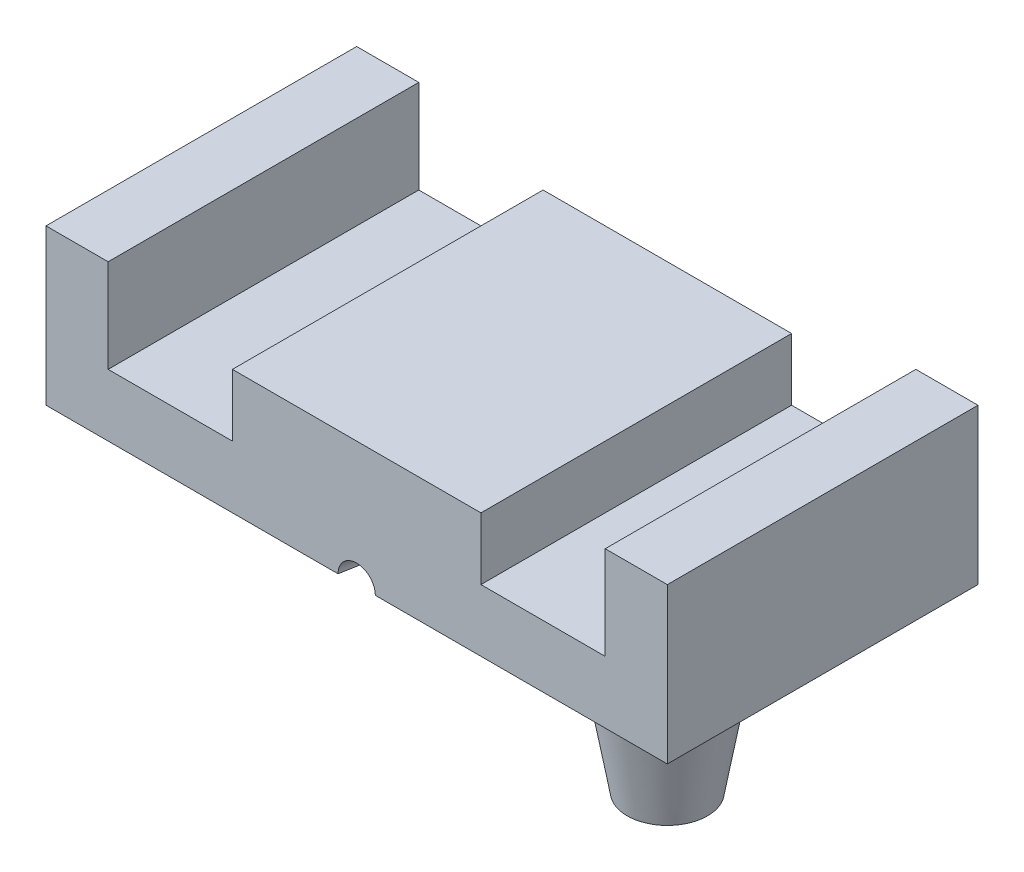
ISO-10303-21;
HEADER;
FILE_DESCRIPTION(('STEP AP214'),'2;1');
FILE_NAME('part.step','',(''),(''),'','','');
FILE_SCHEMA(('AUTOMOTIVE_DESIGN { 1 0 10303 214 1 1 1 1 }'));
ENDSEC;
DATA;
#1=APPLICATION_CONTEXT('core data for automotive mechanical design processes');
#2=APPLICATION_PROTOCOL_DEFINITION('international standard','automotive_design',2000,#1);
#3=PRODUCT_CONTEXT('',#1,'mechanical');
#4=PRODUCT('Part','Part','',(#3));
#5=PRODUCT_RELATED_PRODUCT_CATEGORY('part','',(#4));
#6=PRODUCT_DEFINITION_FORMATION('','',#4);
#7=PRODUCT_DEFINITION_CONTEXT('part definition',#1,'design');
#8=PRODUCT_DEFINITION('design','',#6,#7);
#9=PRODUCT_DEFINITION_SHAPE('','',#8);
#10=(LENGTH_UNIT() NAMED_UNIT(*) SI_UNIT(.MILLI.,.METRE.));
#11=(NAMED_UNIT(*) PLANE_ANGLE_UNIT() SI_UNIT($,.RADIAN.));
#12=(NAMED_UNIT(*) SI_UNIT($,.STERADIAN.) SOLID_ANGLE_UNIT());
#13=UNCERTAINTY_MEASURE_WITH_UNIT(LENGTH_MEASURE(1.E-05),#10,'distance_accuracy_value','');
#14=(GEOMETRIC_REPRESENTATION_CONTEXT(3) GLOBAL_UNCERTAINTY_ASSIGNED_CONTEXT((#13)) GLOBAL_UNIT_ASSIGNED_CONTEXT((#10,
#11,#12)) REPRESENTATION_CONTEXT('',''));
#15=CARTESIAN_POINT('',(0.,0.,0.));
#16=DIRECTION('',(0.,0.,1.));
#17=DIRECTION('',(1.,0.,0.));
#18=AXIS2_PLACEMENT_3D('',#15,#16,#17);
#19=CARTESIAN_POINT('',(0.,0.,0.));
#20=DIRECTION('',(0.,1.,0.));
#21=DIRECTION('',(0.,0.,1.));
#22=AXIS2_PLACEMENT_3D('',#19,#20,#21);
#23=PLANE('',#22);
#24=DIRECTION('',(0.,0.,-1.));
#25=VECTOR('',#24,1.);
#26=CARTESIAN_POINT('',(-20.,0.,12.5));
#27=LINE('',#26,#25);
#28=CARTESIAN_POINT('',(-20.,0.,12.5));
#29=VERTEX_POINT('',#28);
#30=CARTESIAN_POINT('',(-20.,0.,-12.5));
#31=VERTEX_POINT('',#30);
#32=EDGE_CURVE('E210',#29,#31,#27,.T.);
#33=ORIENTED_EDGE('',*,*,#32,.T.);
#34=DIRECTION('',(-1.,0.,0.));
#35=VECTOR('',#34,1.);
#36=CARTESIAN_POINT('',(25.,0.,-12.5));
#37=LINE('',#36,#35);
#38=CARTESIAN_POINT('',(-25.,0.,-12.5));
#39=VERTEX_POINT('',#38);
#40=EDGE_CURVE('E173',#31,#39,#37,.T.);
#41=ORIENTED_EDGE('',*,*,#40,.T.);
#42=DIRECTION('',(0.,0.,1.));
#43=VECTOR('',#42,1.);
#44=CARTESIAN_POINT('',(-25.,0.,12.5));
#45=LINE('',#44,#43);
#46=CARTESIAN_POINT('',(-25.,0.,12.5));
#47=VERTEX_POINT('',#46);
#48=EDGE_CURVE('E178',#39,#47,#45,.T.);
#49=ORIENTED_EDGE('',*,*,#48,.T.);
#50=DIRECTION('',(1.,0.,0.));
#51=VECTOR('',#50,1.);
#52=CARTESIAN_POINT('',(25.,0.,12.5));
#53=LINE('',#52,#51);
#54=EDGE_CURVE('E182',#47,#29,#53,.T.);
#55=ORIENTED_EDGE('',*,*,#54,.T.);
#56=EDGE_LOOP('',(#33,#41,#49,#55));
#57=FACE_BOUND('',#56,.T.);
#58=ADVANCED_FACE('F35',(#57),#23,.T.);
#59=CARTESIAN_POINT('',(0.,-12.5,0.));
#60=DIRECTION('',(0.,1.,0.));
#61=DIRECTION('',(0.,0.,1.));
#62=AXIS2_PLACEMENT_3D('',#59,#60,#61);
#63=PLANE('',#62);
#64=CARTESIAN_POINT('',(0.,-12.5,0.));
#65=DIRECTION('',(0.,-1.,0.));
#66=DIRECTION('',(1.,0.,0.));
#67=AXIS2_PLACEMENT_3D('',#64,#65,#66);
#68=CIRCLE('',#67,10.);
#69=CARTESIAN_POINT('',(-1.04944589700785,-12.5,9.94478070694641));
#70=VERTEX_POINT('',#69);
#71=CARTESIAN_POINT('',(1.04944589700783,-12.5,9.94478070694641));
#72=VERTEX_POINT('',#71);
#73=EDGE_CURVE('E206',#70,#72,#68,.T.);
#74=ORIENTED_EDGE('',*,*,#73,.F.);
#75=DIRECTION('',(-0.173648177666931,0.,0.984807753012208));
#76=VECTOR('',#75,1.);
#77=CARTESIAN_POINT('',(0.,-12.5,3.99307727057346));
#78=LINE('',#77,#76);
#79=CARTESIAN_POINT('',(-1.50000000000001,-12.5,12.5));
#80=VERTEX_POINT('',#79);
#81=EDGE_CURVE('E55',#70,#80,#78,.T.);
#82=ORIENTED_EDGE('',*,*,#81,.T.);
#83=DIRECTION('',(1.,0.,0.));
#84=VECTOR('',#83,1.);
#85=CARTESIAN_POINT('',(25.,-12.5,12.5));
#86=LINE('',#85,#84);
#87=CARTESIAN_POINT('',(-25.,-12.5,12.5));
#88=VERTEX_POINT('',#87);
#89=EDGE_CURVE('E154',#88,#80,#86,.T.);
#90=ORIENTED_EDGE('',*,*,#89,.F.);
#91=DIRECTION('',(0.,0.,1.));
#92=VECTOR('',#91,1.);
#93=CARTESIAN_POINT('',(-25.,-12.5,12.5));
#94=LINE('',#93,#92);
#95=CARTESIAN_POINT('',(-25.,-12.5,-12.5));
#96=VERTEX_POINT('',#95);
#97=EDGE_CURVE('E162',#96,#88,#94,.T.);
#98=ORIENTED_EDGE('',*,*,#97,.F.);
#99=DIRECTION('',(-1.,0.,0.));
#100=VECTOR('',#99,1.);
#101=CARTESIAN_POINT('',(25.,-12.5,-12.5));
#102=LINE('',#101,#100);
#103=CARTESIAN_POINT('',(25.,-12.5,-12.5));
#104=VERTEX_POINT('',#103);
#105=EDGE_CURVE('E166',#104,#96,#102,.T.);
#106=ORIENTED_EDGE('',*,*,#105,.F.);
#107=DIRECTION('',(0.,0.,-1.));
#108=VECTOR('',#107,1.);
#109=CARTESIAN_POINT('',(25.,-12.5,12.5));
#110=LINE('',#109,#108);
#111=CARTESIAN_POINT('',(25.,-12.5,12.5));
#112=VERTEX_POINT('',#111);
#113=EDGE_CURVE('E161',#112,#104,#110,.T.);
#114=ORIENTED_EDGE('',*,*,#113,.F.);
#115=CARTESIAN_POINT('',(1.49999999999999,-12.5,12.5));
#116=VERTEX_POINT('',#115);
#117=EDGE_CURVE('E151',#116,#112,#86,.T.);
#118=ORIENTED_EDGE('',*,*,#117,.F.);
#119=DIRECTION('',(-0.173648177666931,0.,-0.984807753012208));
#120=VECTOR('',#119,1.);
#121=CARTESIAN_POINT('',(0.,-12.5,3.99307727057346));
#122=LINE('',#121,#120);
#123=EDGE_CURVE('E138',#116,#72,#122,.T.);
#124=ORIENTED_EDGE('',*,*,#123,.T.);
#125=EDGE_LOOP('',(#74,#82,#90,#98,#106,#114,#118,#124));
#126=FACE_BOUND('',#125,.T.);
#127=CARTESIAN_POINT('',(17.,-12.5,4.5));
#128=DIRECTION('',(0.,1.,0.));
#129=DIRECTION('',(0.,0.,1.));
#130=AXIS2_PLACEMENT_3D('',#127,#128,#129);
#131=CIRCLE('',#130,5.);
#132=CARTESIAN_POINT('',(17.,-12.5,9.50000000000001));
#133=VERTEX_POINT('',#132);
#134=EDGE_CURVE('E187',#133,#133,#131,.F.);
#135=ORIENTED_EDGE('',*,*,#134,.F.);
#136=EDGE_LOOP('',(#135));
#137=FACE_BOUND('',#136,.T.);
#138=CARTESIAN_POINT('',(-17.,-12.5,-4.5));
#139=DIRECTION('',(0.,1.,0.));
#140=DIRECTION('',(0.,0.,1.));
#141=AXIS2_PLACEMENT_3D('',#138,#139,#140);
#142=CIRCLE('',#141,5.);
#143=CARTESIAN_POINT('',(-17.,-12.5,0.499999999999994));
#144=VERTEX_POINT('',#143);
#145=EDGE_CURVE('E48',#144,#144,#142,.F.);
#146=ORIENTED_EDGE('',*,*,#145,.F.);
#147=EDGE_LOOP('',(#146));
#148=FACE_BOUND('',#147,.T.);
#149=ADVANCED_FACE('F157',(#126,#137,#148),#63,.F.);
#150=CARTESIAN_POINT('',(25.,-12.5,12.5));
#151=DIRECTION('',(1.,0.,0.));
#152=DIRECTION('',(0.,0.,-1.));
#153=AXIS2_PLACEMENT_3D('',#150,#151,#152);
#154=PLANE('',#153);
#155=DIRECTION('',(0.,0.,-1.));
#156=VECTOR('',#155,1.);
#157=CARTESIAN_POINT('',(25.,0.,12.5));
#158=LINE('',#157,#156);
#159=CARTESIAN_POINT('',(25.,0.,12.5));
#160=VERTEX_POINT('',#159);
#161=CARTESIAN_POINT('',(25.,0.,-12.5));
#162=VERTEX_POINT('',#161);
#163=EDGE_CURVE('E170',#160,#162,#158,.T.);
#164=ORIENTED_EDGE('',*,*,#163,.F.);
#165=DIRECTION('',(0.,1.,0.));
#166=VECTOR('',#165,1.);
#167=CARTESIAN_POINT('',(25.,-12.5,12.5));
#168=LINE('',#167,#166);
#169=EDGE_CURVE('E185',#112,#160,#168,.T.);
#170=ORIENTED_EDGE('',*,*,#169,.F.);
#171=ORIENTED_EDGE('',*,*,#113,.T.);
#172=DIRECTION('',(0.,1.,0.));
#173=VECTOR('',#172,1.);
#174=CARTESIAN_POINT('',(25.,-12.5,-12.5));
#175=LINE('',#174,#173);
#176=EDGE_CURVE('E164',#104,#162,#175,.T.);
#177=ORIENTED_EDGE('',*,*,#176,.T.);
#178=EDGE_LOOP('',(#164,#170,#171,#177));
#179=FACE_BOUND('',#178,.T.);
#180=ADVANCED_FACE('F37',(#179),#154,.T.);
#181=CARTESIAN_POINT('',(25.,-12.5,12.5));
#182=DIRECTION('',(0.,0.,1.));
#183=DIRECTION('',(1.,0.,0.));
#184=AXIS2_PLACEMENT_3D('',#181,#182,#183);
#185=PLANE('',#184);
#186=CARTESIAN_POINT('',(0.,-12.5,12.5));
#187=DIRECTION('',(0.,0.,1.));
#188=DIRECTION('',(1.,0.,0.));
#189=AXIS2_PLACEMENT_3D('',#186,#187,#188);
#190=CIRCLE('',#189,1.5);
#191=EDGE_CURVE('E141',#116,#80,#190,.T.);
#192=ORIENTED_EDGE('',*,*,#191,.F.);
#193=ORIENTED_EDGE('',*,*,#117,.T.);
#194=ORIENTED_EDGE('',*,*,#169,.T.);
#195=CARTESIAN_POINT('',(20.,0.,12.5));
#196=VERTEX_POINT('',#195);
#197=EDGE_CURVE('E181',#196,#160,#53,.T.);
#198=ORIENTED_EDGE('',*,*,#197,.F.);
#199=DIRECTION('',(0.,-1.,0.));
#200=VECTOR('',#199,1.);
#201=CARTESIAN_POINT('',(20.,-7.5,12.5));
#202=LINE('',#201,#200);
#203=CARTESIAN_POINT('',(20.,-7.5,12.5));
#204=VERTEX_POINT('',#203);
#205=EDGE_CURVE('E62',#196,#204,#202,.T.);
#206=ORIENTED_EDGE('',*,*,#205,.T.);
#207=DIRECTION('',(-1.,0.,0.));
#208=VECTOR('',#207,1.);
#209=CARTESIAN_POINT('',(10.,-7.5,12.5));
#210=LINE('',#209,#208);
#211=CARTESIAN_POINT('',(10.,-7.5,12.5));
#212=VERTEX_POINT('',#211);
#213=EDGE_CURVE('E282',#204,#212,#210,.T.);
#214=ORIENTED_EDGE('',*,*,#213,.T.);
#215=DIRECTION('',(0.,1.,0.));
#216=VECTOR('',#215,1.);
#217=CARTESIAN_POINT('',(10.,-2.5,12.5));
#218=LINE('',#217,#216);
#219=CARTESIAN_POINT('',(10.,-2.5,12.5));
#220=VERTEX_POINT('',#219);
#221=EDGE_CURVE('E279',#212,#220,#218,.T.);
#222=ORIENTED_EDGE('',*,*,#221,.T.);
#223=DIRECTION('',(-1.,0.,0.));
#224=VECTOR('',#223,1.);
#225=CARTESIAN_POINT('',(-10.,-2.5,12.5));
#226=LINE('',#225,#224);
#227=CARTESIAN_POINT('',(-10.,-2.5,12.5));
#228=VERTEX_POINT('',#227);
#229=EDGE_CURVE('E276',#220,#228,#226,.T.);
#230=ORIENTED_EDGE('',*,*,#229,.T.);
#231=DIRECTION('',(0.,-1.,0.));
#232=VECTOR('',#231,1.);
#233=CARTESIAN_POINT('',(-10.,-7.5,12.5));
#234=LINE('',#233,#232);
#235=CARTESIAN_POINT('',(-10.,-7.5,12.5));
#236=VERTEX_POINT('',#235);
#237=EDGE_CURVE('E273',#228,#236,#234,.T.);
#238=ORIENTED_EDGE('',*,*,#237,.T.);
#239=DIRECTION('',(-1.,0.,0.));
#240=VECTOR('',#239,1.);
#241=CARTESIAN_POINT('',(-20.,-7.5,12.5));
#242=LINE('',#241,#240);
#243=CARTESIAN_POINT('',(-20.,-7.5,12.5));
#244=VERTEX_POINT('',#243);
#245=EDGE_CURVE('E238',#236,#244,#242,.T.);
#246=ORIENTED_EDGE('',*,*,#245,.T.);
#247=DIRECTION('',(0.,1.,0.));
#248=VECTOR('',#247,1.);
#249=CARTESIAN_POINT('',(-20.,0.,12.5));
#250=LINE('',#249,#248);
#251=EDGE_CURVE('E234',#244,#29,#250,.T.);
#252=ORIENTED_EDGE('',*,*,#251,.T.);
#253=ORIENTED_EDGE('',*,*,#54,.F.);
#254=DIRECTION('',(0.,1.,0.));
#255=VECTOR('',#254,1.);
#256=CARTESIAN_POINT('',(-25.,-12.5,12.5));
#257=LINE('',#256,#255);
#258=EDGE_CURVE('E188',#88,#47,#257,.T.);
#259=ORIENTED_EDGE('',*,*,#258,.F.);
#260=ORIENTED_EDGE('',*,*,#89,.T.);
#261=EDGE_LOOP('',(#192,#193,#194,#198,#206,#214,#222,#230,#238,#246,#252,#253,#259,#260));
#262=FACE_BOUND('',#261,.T.);
#263=ADVANCED_FACE('F149',(#262),#185,.T.);
#264=CARTESIAN_POINT('',(-25.,-12.5,12.5));
#265=DIRECTION('',(-1.,0.,0.));
#266=DIRECTION('',(0.,0.,1.));
#267=AXIS2_PLACEMENT_3D('',#264,#265,#266);
#268=PLANE('',#267);
#269=ORIENTED_EDGE('',*,*,#48,.F.);
#270=DIRECTION('',(0.,1.,0.));
#271=VECTOR('',#270,1.);
#272=CARTESIAN_POINT('',(-25.,-12.5,-12.5));
#273=LINE('',#272,#271);
#274=EDGE_CURVE('E190',#96,#39,#273,.T.);
#275=ORIENTED_EDGE('',*,*,#274,.F.);
#276=ORIENTED_EDGE('',*,*,#97,.T.);
#277=ORIENTED_EDGE('',*,*,#258,.T.);
#278=EDGE_LOOP('',(#269,#275,#276,#277));
#279=FACE_BOUND('',#278,.T.);
#280=ADVANCED_FACE('F319',(#279),#268,.T.);
#281=CARTESIAN_POINT('',(25.,-12.5,-12.5));
#282=DIRECTION('',(0.,0.,-1.));
#283=DIRECTION('',(-1.,0.,0.));
#284=AXIS2_PLACEMENT_3D('',#281,#282,#283);
#285=PLANE('',#284);
#286=DIRECTION('',(0.,1.,0.));
#287=VECTOR('',#286,1.);
#288=CARTESIAN_POINT('',(-20.,0.,-12.5));
#289=LINE('',#288,#287);
#290=CARTESIAN_POINT('',(-20.,-7.5,-12.5));
#291=VERTEX_POINT('',#290);
#292=EDGE_CURVE('E252',#291,#31,#289,.T.);
#293=ORIENTED_EDGE('',*,*,#292,.F.);
#294=DIRECTION('',(-1.,0.,0.));
#295=VECTOR('',#294,1.);
#296=CARTESIAN_POINT('',(-20.,-7.5,-12.5));
#297=LINE('',#296,#295);
#298=CARTESIAN_POINT('',(-10.,-7.5,-12.5));
#299=VERTEX_POINT('',#298);
#300=EDGE_CURVE('E254',#299,#291,#297,.T.);
#301=ORIENTED_EDGE('',*,*,#300,.F.);
#302=DIRECTION('',(0.,-1.,0.));
#303=VECTOR('',#302,1.);
#304=CARTESIAN_POINT('',(-10.,-7.5,-12.5));
#305=LINE('',#304,#303);
#306=CARTESIAN_POINT('',(-10.,-2.5,-12.5));
#307=VERTEX_POINT('',#306);
#308=EDGE_CURVE('E257',#307,#299,#305,.T.);
#309=ORIENTED_EDGE('',*,*,#308,.F.);
#310=DIRECTION('',(-1.,0.,0.));
#311=VECTOR('',#310,1.);
#312=CARTESIAN_POINT('',(-10.,-2.5,-12.5));
#313=LINE('',#312,#311);
#314=CARTESIAN_POINT('',(10.,-2.5,-12.5));
#315=VERTEX_POINT('',#314);
#316=EDGE_CURVE('E260',#315,#307,#313,.T.);
#317=ORIENTED_EDGE('',*,*,#316,.F.);
#318=DIRECTION('',(0.,1.,0.));
#319=VECTOR('',#318,1.);
#320=CARTESIAN_POINT('',(10.,-2.5,-12.5));
#321=LINE('',#320,#319);
#322=CARTESIAN_POINT('',(10.,-7.5,-12.5));
#323=VERTEX_POINT('',#322);
#324=EDGE_CURVE('E263',#323,#315,#321,.T.);
#325=ORIENTED_EDGE('',*,*,#324,.F.);
#326=DIRECTION('',(-1.,0.,0.));
#327=VECTOR('',#326,1.);
#328=CARTESIAN_POINT('',(10.,-7.5,-12.5));
#329=LINE('',#328,#327);
#330=CARTESIAN_POINT('',(20.,-7.5,-12.5));
#331=VERTEX_POINT('',#330);
#332=EDGE_CURVE('E266',#331,#323,#329,.T.);
#333=ORIENTED_EDGE('',*,*,#332,.F.);
#334=DIRECTION('',(0.,-1.,0.));
#335=VECTOR('',#334,1.);
#336=CARTESIAN_POINT('',(20.,-7.5,-12.5));
#337=LINE('',#336,#335);
#338=CARTESIAN_POINT('',(20.,0.,-12.5));
#339=VERTEX_POINT('',#338);
#340=EDGE_CURVE('E269',#339,#331,#337,.T.);
#341=ORIENTED_EDGE('',*,*,#340,.F.);
#342=EDGE_CURVE('E175',#162,#339,#37,.T.);
#343=ORIENTED_EDGE('',*,*,#342,.F.);
#344=ORIENTED_EDGE('',*,*,#176,.F.);
#345=ORIENTED_EDGE('',*,*,#105,.T.);
#346=ORIENTED_EDGE('',*,*,#274,.T.);
#347=ORIENTED_EDGE('',*,*,#40,.F.);
#348=EDGE_LOOP('',(#293,#301,#309,#317,#325,#333,#341,#343,#344,#345,#346,#347));
#349=FACE_BOUND('',#348,.T.);
#350=ADVANCED_FACE('F219',(#349),#285,.T.);
#351=DIRECTION('',(0.,0.,-1.));
#352=VECTOR('',#351,1.);
#353=CARTESIAN_POINT('',(20.,0.,12.5));
#354=LINE('',#353,#352);
#355=EDGE_CURVE('E230',#196,#339,#354,.T.);
#356=ORIENTED_EDGE('',*,*,#355,.F.);
#357=ORIENTED_EDGE('',*,*,#197,.T.);
#358=ORIENTED_EDGE('',*,*,#163,.T.);
#359=ORIENTED_EDGE('',*,*,#342,.T.);
#360=EDGE_LOOP('',(#356,#357,#358,#359));
#361=FACE_BOUND('',#360,.T.);
#362=ADVANCED_FACE('F229',(#361),#23,.T.);
#363=CARTESIAN_POINT('',(17.,-12.5,4.5));
#364=DIRECTION('',(0.,1.,0.));
#365=DIRECTION('',(0.,0.,-1.));
#366=AXIS2_PLACEMENT_3D('',#363,#364,#365);
#367=CONICAL_SURFACE('',#366,5.,0.174532925199433);
#368=CARTESIAN_POINT('',(17.,-22.5,4.5));
#369=DIRECTION('',(0.,-1.,0.));
#370=DIRECTION('',(0.,0.,-1.));
#371=AXIS2_PLACEMENT_3D('',#368,#369,#370);
#372=CIRCLE('',#371,3.23673019291535);
#373=CARTESIAN_POINT('',(17.,-22.5,1.26326980708466));
#374=VERTEX_POINT('',#373);
#375=EDGE_CURVE('E174',#374,#374,#372,.T.);
#376=ORIENTED_EDGE('',*,*,#375,.F.);
#377=EDGE_LOOP('',(#376));
#378=FACE_BOUND('',#377,.T.);
#379=ORIENTED_EDGE('',*,*,#134,.T.);
#380=EDGE_LOOP('',(#379));
#381=FACE_BOUND('',#380,.T.);
#382=ADVANCED_FACE('F311',(#378,#381),#367,.T.);
#383=CARTESIAN_POINT('',(17.,-22.5,4.5));
#384=DIRECTION('',(0.,-1.,0.));
#385=DIRECTION('',(0.,0.,-1.));
#386=AXIS2_PLACEMENT_3D('',#383,#384,#385);
#387=PLANE('',#386);
#388=ORIENTED_EDGE('',*,*,#375,.T.);
#389=EDGE_LOOP('',(#388));
#390=FACE_BOUND('',#389,.T.);
#391=ADVANCED_FACE('F316',(#390),#387,.T.);
#392=CARTESIAN_POINT('',(-17.,-12.5,-4.5));
#393=DIRECTION('',(0.,1.,0.));
#394=DIRECTION('',(0.,0.,-1.));
#395=AXIS2_PLACEMENT_3D('',#392,#393,#394);
#396=CONICAL_SURFACE('',#395,5.,0.174532925199433);
#397=CARTESIAN_POINT('',(-17.,-22.5,-4.5));
#398=DIRECTION('',(0.,-1.,0.));
#399=DIRECTION('',(0.,0.,-1.));
#400=AXIS2_PLACEMENT_3D('',#397,#398,#399);
#401=CIRCLE('',#400,3.23673019291534);
#402=CARTESIAN_POINT('',(-17.,-22.5,-7.73673019291535));
#403=VERTEX_POINT('',#402);
#404=EDGE_CURVE('E199',#403,#403,#401,.T.);
#405=ORIENTED_EDGE('',*,*,#404,.F.);
#406=EDGE_LOOP('',(#405));
#407=FACE_BOUND('',#406,.T.);
#408=ORIENTED_EDGE('',*,*,#145,.T.);
#409=EDGE_LOOP('',(#408));
#410=FACE_BOUND('',#409,.T.);
#411=ADVANCED_FACE('F297',(#407,#410),#396,.T.);
#412=CARTESIAN_POINT('',(-17.,-22.5,-4.5));
#413=DIRECTION('',(0.,-1.,0.));
#414=DIRECTION('',(0.,0.,-1.));
#415=AXIS2_PLACEMENT_3D('',#412,#413,#414);
#416=PLANE('',#415);
#417=ORIENTED_EDGE('',*,*,#404,.T.);
#418=EDGE_LOOP('',(#417));
#419=FACE_BOUND('',#418,.T.);
#420=ADVANCED_FACE('F289',(#419),#416,.T.);
#421=CARTESIAN_POINT('',(0.,-12.5,0.));
#422=DIRECTION('',(0.,-1.,0.));
#423=DIRECTION('',(1.,0.,0.));
#424=AXIS2_PLACEMENT_3D('',#421,#422,#423);
#425=TOROIDAL_SURFACE('',#424,9.00000000000001,1.);
#426=CARTESIAN_POINT('',(0.,-12.5,0.));
#427=DIRECTION('',(0.,-1.,0.));
#428=DIRECTION('',(1.,0.,0.));
#429=AXIS2_PLACEMENT_3D('',#426,#427,#428);
#430=CIRCLE('',#429,8.00000000000001);
#431=CARTESIAN_POINT('',(8.,-12.5,0.));
#432=VERTEX_POINT('',#431);
#433=EDGE_CURVE('E200',#432,#432,#430,.T.);
#434=ORIENTED_EDGE('',*,*,#433,.F.);
#435=EDGE_LOOP('',(#434));
#436=FACE_BOUND('',#435,.T.);
#437=ORIENTED_EDGE('',*,*,#73,.T.);
#438=CARTESIAN_POINT('',(1.04944587481695,-12.5002,9.9447806891771));
#439=CARTESIAN_POINT('',(1.049453029887,-12.4786074545262,9.94478663234442));
#440=CARTESIAN_POINT('',(1.04867884923305,-12.4570270165581,9.9441664715932));
#441=CARTESIAN_POINT('',(1.04559743771381,-12.414059456684,9.94169946872531));
#442=CARTESIAN_POINT('',(1.043291147782,-12.3926722242886,9.93985337950371));
#443=CARTESIAN_POINT('',(1.0341656877307,-12.3293513868013,9.93255221995564));
#444=CARTESIAN_POINT('',(1.0251389249799,-12.2879104549564,9.92533340142869));
#445=CARTESIAN_POINT('',(1.00179398466275,-12.2076933268858,9.90670563250828));
#446=CARTESIAN_POINT('',(0.987486639353494,-12.1689118669639,9.89530526018808));
#447=CARTESIAN_POINT('',(0.954332155890713,-12.0945768225467,9.86898222864853));
#448=CARTESIAN_POINT('',(0.935477212671396,-12.059028933886,9.85405351461223));
#449=CARTESIAN_POINT('',(0.886538544604347,-11.979474999941,9.81551148242964));
#450=CARTESIAN_POINT('',(0.854855902761344,-11.9370298832398,9.79070633070811));
#451=CARTESIAN_POINT('',(0.786160750167177,-11.8591885507699,9.73762234579365));
#452=CARTESIAN_POINT('',(0.74913613563153,-11.8238087897372,9.70933564613068));
#453=CARTESIAN_POINT('',(0.659765778366542,-11.7508699028247,9.64252159841976));
#454=CARTESIAN_POINT('',(0.606055046169736,-11.7155452818026,9.60336735095429));
#455=CARTESIAN_POINT('',(0.521088790451227,-11.67062201923,9.54511454661019));
#456=CARTESIAN_POINT('',(0.492023735979263,-11.6569885938323,9.52577083496023));
#457=CARTESIAN_POINT('',(0.432316932504303,-11.6323194252872,9.48788856986161));
#458=CARTESIAN_POINT('',(0.401676349675538,-11.6212817935771,9.46934943910041));
#459=CARTESIAN_POINT('',(0.338829597574446,-11.6018276046664,9.43411723337558));
#460=CARTESIAN_POINT('',(0.306635215858728,-11.5933940785977,9.41741268464202));
#461=CARTESIAN_POINT('',(0.240253449249137,-11.5790992208503,9.38717526648825));
#462=CARTESIAN_POINT('',(0.20607035480672,-11.5732325686725,9.37363586390464));
#463=CARTESIAN_POINT('',(0.142708191878177,-11.5651203169054,9.35405913574631));
#464=CARTESIAN_POINT('',(0.113900891971095,-11.5623844051014,9.34706171536446));
#465=CARTESIAN_POINT('',(0.0554554169750189,-11.5587775935394,9.33771272940806));
#466=CARTESIAN_POINT('',(0.025819600384998,-11.5579018566662,9.33534911552938));
#467=CARTESIAN_POINT('',(-0.0334783191867052,-11.5580643617533,9.33578023123696));
#468=CARTESIAN_POINT('',(-0.0631403144128048,-11.5591072046324,9.33858736072875));
#469=CARTESIAN_POINT('',(-0.121575663017206,-11.5630474563939,9.34875614529325));
#470=CARTESIAN_POINT('',(-0.150346319769395,-11.5659500075788,9.35613042716324));
#471=CARTESIAN_POINT('',(-0.224008763865442,-11.5758305398527,9.37976982100939));
#472=CARTESIAN_POINT('',(-0.267819397037247,-11.5842199536854,9.3987123507444));
#473=CARTESIAN_POINT('',(-0.352301606863562,-11.60528617719,9.44085623294253));
#474=CARTESIAN_POINT('',(-0.392958151721643,-11.6179821327577,9.4640763883615));
#475=CARTESIAN_POINT('',(-0.462962938005664,-11.6444299105024,9.50699490949171));
#476=CARTESIAN_POINT('',(-0.492840185422401,-11.6573440508933,9.52635335944254));
#477=CARTESIAN_POINT('',(-0.55103963108402,-11.6858688638963,9.56542293199447));
#478=CARTESIAN_POINT('',(-0.57936103628062,-11.7014808951821,9.58513422778549));
#479=CARTESIAN_POINT('',(-0.66187091358836,-11.7524432239878,9.64386941946843));
#480=CARTESIAN_POINT('',(-0.713802240103083,-11.7919931411317,9.68262342248612));
#481=CARTESIAN_POINT('',(-0.796068880617272,-11.8697747015128,9.74521303389615));
#482=CARTESIAN_POINT('',(-0.828322748515192,-11.9051218776851,9.77013633584441));
#483=CARTESIAN_POINT('',(-0.887818054002304,-11.9818462516564,9.81649891548575));
#484=CARTESIAN_POINT('',(-0.915065918172661,-12.0232155942472,9.8379426559604));
#485=CARTESIAN_POINT('',(-0.958893435028447,-12.1037530095708,9.87258957845196));
#486=CARTESIAN_POINT('',(-0.976507494285601,-12.1420172895427,9.88657938937636));
#487=CARTESIAN_POINT('',(-1.00649360333872,-12.2217224558064,9.91044735402347));
#488=CARTESIAN_POINT('',(-1.01887542764697,-12.2631572465194,9.92033317393483));
#489=CARTESIAN_POINT('',(-1.03521682609634,-12.337227077425,9.93339236957372));
#490=CARTESIAN_POINT('',(-1.04052404692112,-12.3693812216667,9.9376386363884));
#491=CARTESIAN_POINT('',(-1.04765838790264,-12.4344113786351,9.94334936078253));
#492=CARTESIAN_POINT('',(-1.04947502486621,-12.4672892668458,9.94480543861376));
#493=CARTESIAN_POINT('',(-1.04944587481697,-12.5002,9.9447806891771));
#494=B_SPLINE_CURVE_WITH_KNOTS('',3,(#438,#439,#440,#441,#442,#443,#444,#445,#446,#447,#448,
#449,#450,#451,#452,#453,#454,#455,#456,#457,#458,#459,#460,#461,#462,#463,#464,#465,#466,#467,
#468,#469,#470,#471,#472,#473,#474,#475,#476,#477,#478,#479,#480,#481,#482,#483,#484,#485,#486,
#487,#488,#489,#490,#491,#492,#493),.UNSPECIFIED.,.F.,.F.,(4,2,2,2,2,2,2,2,2,2,2,2,2,2,2,2,2,2,
2,2,2,2,2,2,2,2,2,4),(0.,0.0647309271291451,0.129422136948713,0.257775465900895,
0.385866949121519,0.514179860723938,0.688676872755038,0.863575654968488,1.08814427063154,
1.2004976596882,1.31276905169545,1.42429262126901,1.53558392195614,1.62454972571897,
1.71328390216435,1.80223114819837,1.89142541107272,2.03599671729536,2.18121936671072,
2.29469236824293,2.40822268287528,2.63455153670979,2.79586979354844,2.95697948445844,
3.08960699896316,3.22198564036923,3.32028262991372,3.41887437401153),.UNSPECIFIED.);
#495=EDGE_CURVE('E11',#72,#70,#494,.T.);
#496=ORIENTED_EDGE('',*,*,#495,.T.);
#497=EDGE_LOOP('',(#437,#496));
#498=FACE_BOUND('',#497,.T.);
#499=ADVANCED_FACE('F286',(#436,#498),#425,.F.);
#500=CARTESIAN_POINT('',(0.,-12.5,0.));
#501=DIRECTION('',(0.,-1.,0.));
#502=DIRECTION('',(-1.,0.,0.));
#503=AXIS2_PLACEMENT_3D('',#500,#501,#502);
#504=SPHERICAL_SURFACE('',#503,7.5);
#505=CARTESIAN_POINT('',(0.,-12.5,0.));
#506=DIRECTION('',(0.,1.,0.));
#507=DIRECTION('',(0.,0.,1.));
#508=AXIS2_PLACEMENT_3D('',#505,#506,#507);
#509=CIRCLE('',#508,7.5);
#510=CARTESIAN_POINT('',(0.,-12.5,7.5));
#511=VERTEX_POINT('',#510);
#512=EDGE_CURVE('E197',#511,#511,#509,.F.);
#513=ORIENTED_EDGE('',*,*,#512,.T.);
#514=EDGE_LOOP('',(#513));
#515=FACE_BOUND('',#514,.T.);
#516=ADVANCED_FACE('F288',(#515),#504,.F.);
#517=ORIENTED_EDGE('',*,*,#512,.F.);
#518=EDGE_LOOP('',(#517));
#519=FACE_BOUND('',#518,.T.);
#520=ORIENTED_EDGE('',*,*,#433,.T.);
#521=EDGE_LOOP('',(#520));
#522=FACE_BOUND('',#521,.T.);
#523=ADVANCED_FACE('F295',(#519,#522),#63,.F.);
#524=CARTESIAN_POINT('',(-20.,0.,12.5));
#525=DIRECTION('',(-1.,0.,0.));
#526=DIRECTION('',(0.,-1.,0.));
#527=AXIS2_PLACEMENT_3D('',#524,#525,#526);
#528=PLANE('',#527);
#529=ORIENTED_EDGE('',*,*,#292,.T.);
#530=ORIENTED_EDGE('',*,*,#32,.F.);
#531=ORIENTED_EDGE('',*,*,#251,.F.);
#532=DIRECTION('',(0.,0.,-1.));
#533=VECTOR('',#532,1.);
#534=CARTESIAN_POINT('',(-20.,-7.5,12.5));
#535=LINE('',#534,#533);
#536=EDGE_CURVE('E248',#244,#291,#535,.T.);
#537=ORIENTED_EDGE('',*,*,#536,.T.);
#538=EDGE_LOOP('',(#529,#530,#531,#537));
#539=FACE_BOUND('',#538,.T.);
#540=ADVANCED_FACE('F351',(#539),#528,.F.);
#541=CARTESIAN_POINT('',(-20.,-7.5,12.5));
#542=DIRECTION('',(0.,-1.,0.));
#543=DIRECTION('',(0.,0.,-1.));
#544=AXIS2_PLACEMENT_3D('',#541,#542,#543);
#545=PLANE('',#544);
#546=ORIENTED_EDGE('',*,*,#300,.T.);
#547=ORIENTED_EDGE('',*,*,#536,.F.);
#548=ORIENTED_EDGE('',*,*,#245,.F.);
#549=DIRECTION('',(0.,0.,-1.));
#550=VECTOR('',#549,1.);
#551=CARTESIAN_POINT('',(-10.,-7.5,12.5));
#552=LINE('',#551,#550);
#553=EDGE_CURVE('E246',#236,#299,#552,.T.);
#554=ORIENTED_EDGE('',*,*,#553,.T.);
#555=EDGE_LOOP('',(#546,#547,#548,#554));
#556=FACE_BOUND('',#555,.T.);
#557=ADVANCED_FACE('F419',(#556),#545,.F.);
#558=CARTESIAN_POINT('',(-10.,-7.5,12.5));
#559=DIRECTION('',(1.,0.,0.));
#560=DIRECTION('',(0.,0.,-1.));
#561=AXIS2_PLACEMENT_3D('',#558,#559,#560);
#562=PLANE('',#561);
#563=ORIENTED_EDGE('',*,*,#308,.T.);
#564=ORIENTED_EDGE('',*,*,#553,.F.);
#565=ORIENTED_EDGE('',*,*,#237,.F.);
#566=DIRECTION('',(0.,0.,-1.));
#567=VECTOR('',#566,1.);
#568=CARTESIAN_POINT('',(-10.,-2.5,12.5));
#569=LINE('',#568,#567);
#570=EDGE_CURVE('E244',#228,#307,#569,.T.);
#571=ORIENTED_EDGE('',*,*,#570,.T.);
#572=EDGE_LOOP('',(#563,#564,#565,#571));
#573=FACE_BOUND('',#572,.T.);
#574=ADVANCED_FACE('F428',(#573),#562,.F.);
#575=CARTESIAN_POINT('',(-10.,-2.5,12.5));
#576=DIRECTION('',(0.,-1.,0.));
#577=DIRECTION('',(1.,0.,0.));
#578=AXIS2_PLACEMENT_3D('',#575,#576,#577);
#579=PLANE('',#578);
#580=ORIENTED_EDGE('',*,*,#316,.T.);
#581=ORIENTED_EDGE('',*,*,#570,.F.);
#582=ORIENTED_EDGE('',*,*,#229,.F.);
#583=DIRECTION('',(0.,0.,-1.));
#584=VECTOR('',#583,1.);
#585=CARTESIAN_POINT('',(10.,-2.5,12.5));
#586=LINE('',#585,#584);
#587=EDGE_CURVE('E242',#220,#315,#586,.T.);
#588=ORIENTED_EDGE('',*,*,#587,.T.);
#589=EDGE_LOOP('',(#580,#581,#582,#588));
#590=FACE_BOUND('',#589,.T.);
#591=ADVANCED_FACE('F437',(#590),#579,.F.);
#592=CARTESIAN_POINT('',(10.,-2.5,12.5));
#593=DIRECTION('',(-1.,0.,0.));
#594=DIRECTION('',(0.,0.,1.));
#595=AXIS2_PLACEMENT_3D('',#592,#593,#594);
#596=PLANE('',#595);
#597=ORIENTED_EDGE('',*,*,#324,.T.);
#598=ORIENTED_EDGE('',*,*,#587,.F.);
#599=ORIENTED_EDGE('',*,*,#221,.F.);
#600=DIRECTION('',(0.,0.,-1.));
#601=VECTOR('',#600,1.);
#602=CARTESIAN_POINT('',(10.,-7.5,12.5));
#603=LINE('',#602,#601);
#604=EDGE_CURVE('E235',#212,#323,#603,.T.);
#605=ORIENTED_EDGE('',*,*,#604,.T.);
#606=EDGE_LOOP('',(#597,#598,#599,#605));
#607=FACE_BOUND('',#606,.T.);
#608=ADVANCED_FACE('F446',(#607),#596,.F.);
#609=CARTESIAN_POINT('',(10.,-7.5,12.5));
#610=DIRECTION('',(0.,-1.,0.));
#611=DIRECTION('',(1.,0.,0.));
#612=AXIS2_PLACEMENT_3D('',#609,#610,#611);
#613=PLANE('',#612);
#614=ORIENTED_EDGE('',*,*,#332,.T.);
#615=ORIENTED_EDGE('',*,*,#604,.F.);
#616=ORIENTED_EDGE('',*,*,#213,.F.);
#617=DIRECTION('',(0.,0.,-1.));
#618=VECTOR('',#617,1.);
#619=CARTESIAN_POINT('',(20.,-7.5,12.5));
#620=LINE('',#619,#618);
#621=EDGE_CURVE('E233',#204,#331,#620,.T.);
#622=ORIENTED_EDGE('',*,*,#621,.T.);
#623=EDGE_LOOP('',(#614,#615,#616,#622));
#624=FACE_BOUND('',#623,.T.);
#625=ADVANCED_FACE('F455',(#624),#613,.F.);
#626=CARTESIAN_POINT('',(20.,-7.5,12.5));
#627=DIRECTION('',(1.,0.,0.));
#628=DIRECTION('',(0.,0.,-1.));
#629=AXIS2_PLACEMENT_3D('',#626,#627,#628);
#630=PLANE('',#629);
#631=ORIENTED_EDGE('',*,*,#340,.T.);
#632=ORIENTED_EDGE('',*,*,#621,.F.);
#633=ORIENTED_EDGE('',*,*,#205,.F.);
#634=ORIENTED_EDGE('',*,*,#355,.T.);
#635=EDGE_LOOP('',(#631,#632,#633,#634));
#636=FACE_BOUND('',#635,.T.);
#637=ADVANCED_FACE('F464',(#636),#630,.F.);
#638=CARTESIAN_POINT('',(0.,-12.5,12.5));
#639=DIRECTION('',(0.,0.,1.));
#640=DIRECTION('',(1.,0.,0.));
#641=AXIS2_PLACEMENT_3D('',#638,#639,#640);
#642=CONICAL_SURFACE('',#641,1.5,0.174532925199433);
#643=ORIENTED_EDGE('',*,*,#495,.F.);
#644=ORIENTED_EDGE('',*,*,#123,.F.);
#645=ORIENTED_EDGE('',*,*,#191,.T.);
#646=ORIENTED_EDGE('',*,*,#81,.F.);
#647=EDGE_LOOP('',(#643,#644,#645,#646));
#648=FACE_BOUND('',#647,.T.);
#649=ADVANCED_FACE('F140',(#648),#642,.F.);
#650=CLOSED_SHELL('',(#58,#149,#180,#263,#280,#350,#362,#382,#391,#411,#420,#499,#516,#523,#540,
#557,#574,#591,#608,#625,#637,#649));
#651=MANIFOLD_SOLID_BREP('B2',#650);
#652=ADVANCED_BREP_SHAPE_REPRESENTATION('',(#18,#651),#14);
#653=SHAPE_DEFINITION_REPRESENTATION(#9,#652);
ENDSEC;
END-ISO-10303-21;
